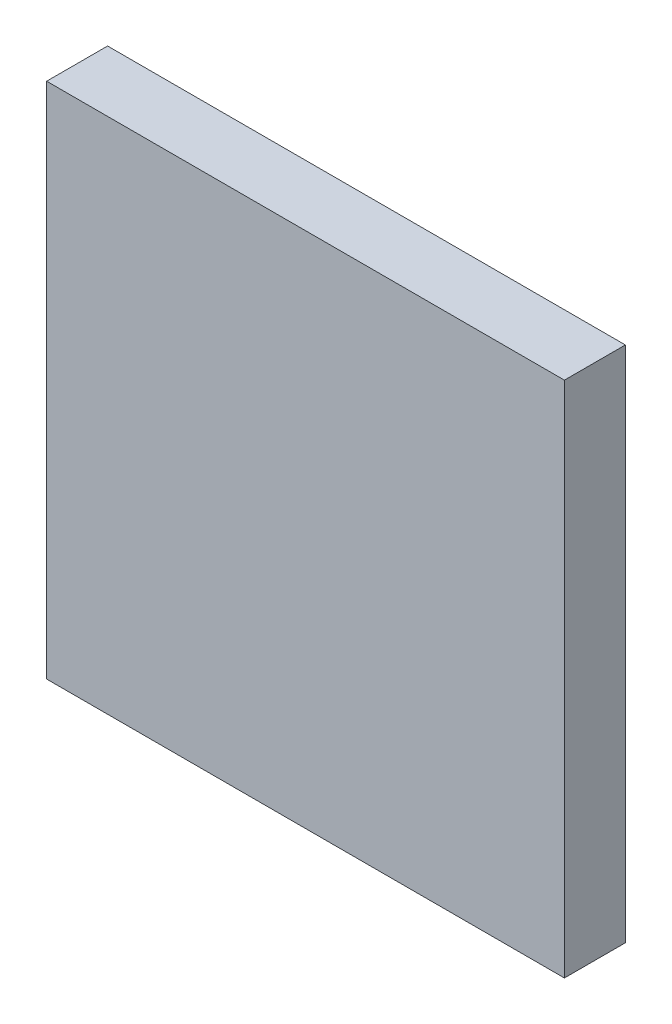
ISO-10303-21;
HEADER;
FILE_DESCRIPTION(('STEP AP214'),'2;1');
FILE_NAME('part.step','',(''),(''),'','','');
FILE_SCHEMA(('AUTOMOTIVE_DESIGN { 1 0 10303 214 1 1 1 1 }'));
ENDSEC;
DATA;
#1=APPLICATION_CONTEXT('core data for automotive mechanical design processes');
#2=APPLICATION_PROTOCOL_DEFINITION('international standard','automotive_design',2000,#1);
#3=PRODUCT_CONTEXT('',#1,'mechanical');
#4=PRODUCT('Part','Part','',(#3));
#5=PRODUCT_RELATED_PRODUCT_CATEGORY('part','',(#4));
#6=PRODUCT_DEFINITION_FORMATION('','',#4);
#7=PRODUCT_DEFINITION_CONTEXT('part definition',#1,'design');
#8=PRODUCT_DEFINITION('design','',#6,#7);
#9=PRODUCT_DEFINITION_SHAPE('','',#8);
#10=(LENGTH_UNIT() NAMED_UNIT(*) SI_UNIT(.MILLI.,.METRE.));
#11=(NAMED_UNIT(*) PLANE_ANGLE_UNIT() SI_UNIT($,.RADIAN.));
#12=(NAMED_UNIT(*) SI_UNIT($,.STERADIAN.) SOLID_ANGLE_UNIT());
#13=UNCERTAINTY_MEASURE_WITH_UNIT(LENGTH_MEASURE(1.E-05),#10,'distance_accuracy_value','');
#14=(GEOMETRIC_REPRESENTATION_CONTEXT(3) GLOBAL_UNCERTAINTY_ASSIGNED_CONTEXT((#13)) GLOBAL_UNIT_ASSIGNED_CONTEXT((#10,
#11,#12)) REPRESENTATION_CONTEXT('',''));
#15=CARTESIAN_POINT('',(0.,0.,0.));
#16=DIRECTION('',(0.,0.,1.));
#17=DIRECTION('',(1.,0.,0.));
#18=AXIS2_PLACEMENT_3D('',#15,#16,#17);
#19=CARTESIAN_POINT('',(0.,0.,0.729999999999874));
#20=DIRECTION('',(0.,0.,1.));
#21=DIRECTION('',(1.,0.,0.));
#22=AXIS2_PLACEMENT_3D('',#19,#20,#21);
#23=PLANE('',#22);
#24=DIRECTION('',(1.,0.,0.));
#25=VECTOR('',#24,1.);
#26=CARTESIAN_POINT('',(-3.1000000000003,-3.1000000000003,0.729999999999874));
#27=LINE('',#26,#25);
#28=CARTESIAN_POINT('',(-3.1000000000003,-3.1000000000003,0.729999999999874));
#29=VERTEX_POINT('',#28);
#30=CARTESIAN_POINT('',(3.1000000000003,-3.1000000000003,0.729999999999874));
#31=VERTEX_POINT('',#30);
#32=EDGE_CURVE('E85',#29,#31,#27,.T.);
#33=ORIENTED_EDGE('',*,*,#32,.T.);
#34=DIRECTION('',(0.,1.,0.));
#35=VECTOR('',#34,1.);
#36=CARTESIAN_POINT('',(3.1000000000003,-3.1000000000003,0.729999999999874));
#37=LINE('',#36,#35);
#38=CARTESIAN_POINT('',(3.1000000000003,3.1000000000003,0.729999999999874));
#39=VERTEX_POINT('',#38);
#40=EDGE_CURVE('E11',#31,#39,#37,.T.);
#41=ORIENTED_EDGE('',*,*,#40,.T.);
#42=DIRECTION('',(-1.,0.,0.));
#43=VECTOR('',#42,1.);
#44=CARTESIAN_POINT('',(3.1000000000003,3.1000000000003,0.729999999999874));
#45=LINE('',#44,#43);
#46=CARTESIAN_POINT('',(-3.1000000000003,3.1000000000003,0.729999999999874));
#47=VERTEX_POINT('',#46);
#48=EDGE_CURVE('E105',#39,#47,#45,.T.);
#49=ORIENTED_EDGE('',*,*,#48,.T.);
#50=DIRECTION('',(0.,-1.,0.));
#51=VECTOR('',#50,1.);
#52=CARTESIAN_POINT('',(-3.1000000000003,3.1000000000003,0.729999999999874));
#53=LINE('',#52,#51);
#54=EDGE_CURVE('E81',#47,#29,#53,.T.);
#55=ORIENTED_EDGE('',*,*,#54,.T.);
#56=EDGE_LOOP('',(#33,#41,#49,#55));
#57=FACE_BOUND('',#56,.T.);
#58=ADVANCED_FACE('F16',(#57),#23,.T.);
#59=CARTESIAN_POINT('',(3.1000000000003,-3.1000000000003,0.));
#60=DIRECTION('',(1.,0.,0.));
#61=DIRECTION('',(0.,1.,0.));
#62=AXIS2_PLACEMENT_3D('',#59,#60,#61);
#63=PLANE('',#62);
#64=DIRECTION('',(0.,1.,0.));
#65=VECTOR('',#64,1.);
#66=CARTESIAN_POINT('',(3.1000000000003,-3.1000000000003,0.));
#67=LINE('',#66,#65);
#68=CARTESIAN_POINT('',(3.1000000000003,-3.1000000000003,0.));
#69=VERTEX_POINT('',#68);
#70=CARTESIAN_POINT('',(3.1000000000003,3.1000000000003,0.));
#71=VERTEX_POINT('',#70);
#72=EDGE_CURVE('E91',#69,#71,#67,.T.);
#73=ORIENTED_EDGE('',*,*,#72,.T.);
#74=DIRECTION('',(0.,0.,1.));
#75=VECTOR('',#74,1.);
#76=CARTESIAN_POINT('',(3.1000000000003,3.1000000000003,0.));
#77=LINE('',#76,#75);
#78=EDGE_CURVE('E27',#71,#39,#77,.T.);
#79=ORIENTED_EDGE('',*,*,#78,.T.);
#80=ORIENTED_EDGE('',*,*,#40,.F.);
#81=DIRECTION('',(0.,0.,1.));
#82=VECTOR('',#81,1.);
#83=CARTESIAN_POINT('',(3.1000000000003,-3.1000000000003,0.));
#84=LINE('',#83,#82);
#85=EDGE_CURVE('E68',#69,#31,#84,.T.);
#86=ORIENTED_EDGE('',*,*,#85,.F.);
#87=EDGE_LOOP('',(#73,#79,#80,#86));
#88=FACE_BOUND('',#87,.T.);
#89=ADVANCED_FACE('F18',(#88),#63,.T.);
#90=CARTESIAN_POINT('',(3.1000000000003,3.1000000000003,0.));
#91=DIRECTION('',(0.,1.,0.));
#92=DIRECTION('',(1.,0.,0.));
#93=AXIS2_PLACEMENT_3D('',#90,#91,#92);
#94=PLANE('',#93);
#95=DIRECTION('',(-1.,0.,0.));
#96=VECTOR('',#95,1.);
#97=CARTESIAN_POINT('',(3.1000000000003,3.1000000000003,0.));
#98=LINE('',#97,#96);
#99=CARTESIAN_POINT('',(-3.1000000000003,3.1000000000003,0.));
#100=VERTEX_POINT('',#99);
#101=EDGE_CURVE('E97',#71,#100,#98,.T.);
#102=ORIENTED_EDGE('',*,*,#101,.T.);
#103=DIRECTION('',(0.,0.,1.));
#104=VECTOR('',#103,1.);
#105=CARTESIAN_POINT('',(-3.1000000000003,3.1000000000003,0.));
#106=LINE('',#105,#104);
#107=EDGE_CURVE('E77',#100,#47,#106,.T.);
#108=ORIENTED_EDGE('',*,*,#107,.T.);
#109=ORIENTED_EDGE('',*,*,#48,.F.);
#110=ORIENTED_EDGE('',*,*,#78,.F.);
#111=EDGE_LOOP('',(#102,#108,#109,#110));
#112=FACE_BOUND('',#111,.T.);
#113=ADVANCED_FACE('F131',(#112),#94,.T.);
#114=CARTESIAN_POINT('',(-3.1000000000003,3.1000000000003,0.));
#115=DIRECTION('',(-1.,0.,0.));
#116=DIRECTION('',(0.,0.,1.));
#117=AXIS2_PLACEMENT_3D('',#114,#115,#116);
#118=PLANE('',#117);
#119=DIRECTION('',(0.,-1.,0.));
#120=VECTOR('',#119,1.);
#121=CARTESIAN_POINT('',(-3.1000000000003,3.1000000000003,0.));
#122=LINE('',#121,#120);
#123=CARTESIAN_POINT('',(-3.1000000000003,-3.1000000000003,0.));
#124=VERTEX_POINT('',#123);
#125=EDGE_CURVE('E101',#100,#124,#122,.T.);
#126=ORIENTED_EDGE('',*,*,#125,.T.);
#127=DIRECTION('',(0.,0.,1.));
#128=VECTOR('',#127,1.);
#129=CARTESIAN_POINT('',(-3.1000000000003,-3.1000000000003,0.));
#130=LINE('',#129,#128);
#131=EDGE_CURVE('E60',#124,#29,#130,.T.);
#132=ORIENTED_EDGE('',*,*,#131,.T.);
#133=ORIENTED_EDGE('',*,*,#54,.F.);
#134=ORIENTED_EDGE('',*,*,#107,.F.);
#135=EDGE_LOOP('',(#126,#132,#133,#134));
#136=FACE_BOUND('',#135,.T.);
#137=ADVANCED_FACE('F112',(#136),#118,.T.);
#138=CARTESIAN_POINT('',(-3.1000000000003,-3.1000000000003,0.));
#139=DIRECTION('',(0.,-1.,0.));
#140=DIRECTION('',(0.,0.,-1.));
#141=AXIS2_PLACEMENT_3D('',#138,#139,#140);
#142=PLANE('',#141);
#143=DIRECTION('',(1.,0.,0.));
#144=VECTOR('',#143,1.);
#145=CARTESIAN_POINT('',(-3.1000000000003,-3.1000000000003,0.));
#146=LINE('',#145,#144);
#147=EDGE_CURVE('E20',#124,#69,#146,.T.);
#148=ORIENTED_EDGE('',*,*,#147,.T.);
#149=ORIENTED_EDGE('',*,*,#85,.T.);
#150=ORIENTED_EDGE('',*,*,#32,.F.);
#151=ORIENTED_EDGE('',*,*,#131,.F.);
#152=EDGE_LOOP('',(#148,#149,#150,#151));
#153=FACE_BOUND('',#152,.T.);
#154=ADVANCED_FACE('F88',(#153),#142,.T.);
#155=CARTESIAN_POINT('',(0.,0.,0.));
#156=DIRECTION('',(0.,0.,1.));
#157=DIRECTION('',(1.,0.,0.));
#158=AXIS2_PLACEMENT_3D('',#155,#156,#157);
#159=PLANE('',#158);
#160=ORIENTED_EDGE('',*,*,#147,.F.);
#161=ORIENTED_EDGE('',*,*,#125,.F.);
#162=ORIENTED_EDGE('',*,*,#101,.F.);
#163=ORIENTED_EDGE('',*,*,#72,.F.);
#164=EDGE_LOOP('',(#160,#161,#162,#163));
#165=FACE_BOUND('',#164,.T.);
#166=ADVANCED_FACE('F116',(#165),#159,.F.);
#167=CLOSED_SHELL('',(#58,#89,#113,#137,#154,#166));
#168=MANIFOLD_SOLID_BREP('B1',#167);
#169=ADVANCED_BREP_SHAPE_REPRESENTATION('',(#18,#168),#14);
#170=SHAPE_DEFINITION_REPRESENTATION(#9,#169);
ENDSEC;
END-ISO-10303-21;
